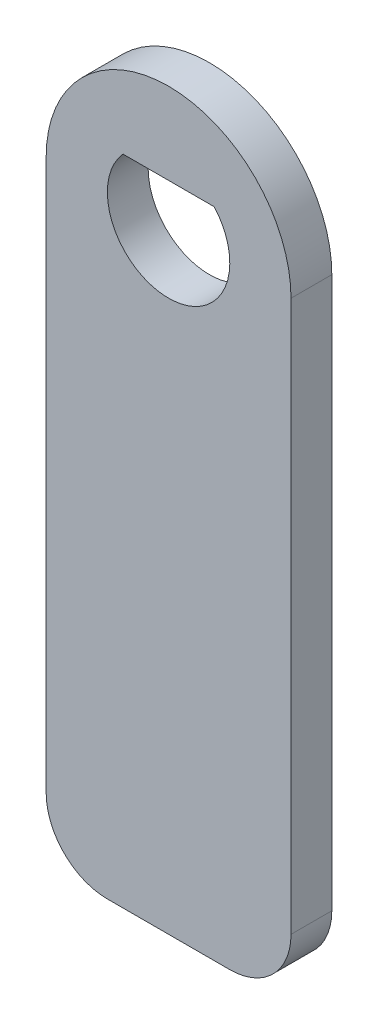
ISO-10303-21;
HEADER;
FILE_DESCRIPTION(('STEP AP214'),'2;1');
FILE_NAME('part.step','',(''),(''),'','','');
FILE_SCHEMA(('AUTOMOTIVE_DESIGN { 1 0 10303 214 1 1 1 1 }'));
ENDSEC;
DATA;
#1=APPLICATION_CONTEXT('core data for automotive mechanical design processes');
#2=APPLICATION_PROTOCOL_DEFINITION('international standard','automotive_design',2000,#1);
#3=PRODUCT_CONTEXT('',#1,'mechanical');
#4=PRODUCT('Part','Part','',(#3));
#5=PRODUCT_RELATED_PRODUCT_CATEGORY('part','',(#4));
#6=PRODUCT_DEFINITION_FORMATION('','',#4);
#7=PRODUCT_DEFINITION_CONTEXT('part definition',#1,'design');
#8=PRODUCT_DEFINITION('design','',#6,#7);
#9=PRODUCT_DEFINITION_SHAPE('','',#8);
#10=(LENGTH_UNIT() NAMED_UNIT(*) SI_UNIT(.MILLI.,.METRE.));
#11=(NAMED_UNIT(*) PLANE_ANGLE_UNIT() SI_UNIT($,.RADIAN.));
#12=(NAMED_UNIT(*) SI_UNIT($,.STERADIAN.) SOLID_ANGLE_UNIT());
#13=UNCERTAINTY_MEASURE_WITH_UNIT(LENGTH_MEASURE(1.E-05),#10,'distance_accuracy_value','');
#14=(GEOMETRIC_REPRESENTATION_CONTEXT(3) GLOBAL_UNCERTAINTY_ASSIGNED_CONTEXT((#13)) GLOBAL_UNIT_ASSIGNED_CONTEXT((#10,
#11,#12)) REPRESENTATION_CONTEXT('',''));
#15=CARTESIAN_POINT('',(0.,0.,0.));
#16=DIRECTION('',(0.,0.,1.));
#17=DIRECTION('',(1.,0.,0.));
#18=AXIS2_PLACEMENT_3D('',#15,#16,#17);
#19=CARTESIAN_POINT('',(3.00000000000001,-27.,2.));
#20=DIRECTION('',(0.,0.,-1.));
#21=DIRECTION('',(-1.,0.,0.));
#22=AXIS2_PLACEMENT_3D('',#19,#20,#21);
#23=PLANE('',#22);
#24=CARTESIAN_POINT('',(3.00000000000001,-27.,2.));
#25=DIRECTION('',(0.,0.,1.));
#26=DIRECTION('',(-1.,0.,0.));
#27=AXIS2_PLACEMENT_3D('',#24,#25,#26);
#28=CIRCLE('',#27,3.);
#29=CARTESIAN_POINT('',(3.00000000000001,-30.,2.));
#30=VERTEX_POINT('',#29);
#31=CARTESIAN_POINT('',(6.00000000000001,-27.,2.));
#32=VERTEX_POINT('',#31);
#33=EDGE_CURVE('E133',#30,#32,#28,.T.);
#34=ORIENTED_EDGE('',*,*,#33,.T.);
#35=DIRECTION('',(0.,1.,0.));
#36=VECTOR('',#35,1.);
#37=CARTESIAN_POINT('',(6.00000000000001,-27.,2.));
#38=LINE('',#37,#36);
#39=CARTESIAN_POINT('',(6.,0.,2.));
#40=VERTEX_POINT('',#39);
#41=EDGE_CURVE('E137',#32,#40,#38,.T.);
#42=ORIENTED_EDGE('',*,*,#41,.T.);
#43=CARTESIAN_POINT('',(0.,0.,2.));
#44=DIRECTION('',(0.,0.,1.));
#45=DIRECTION('',(1.,0.,0.));
#46=AXIS2_PLACEMENT_3D('',#43,#44,#45);
#47=CIRCLE('',#46,6.);
#48=CARTESIAN_POINT('',(-6.,0.,2.));
#49=VERTEX_POINT('',#48);
#50=EDGE_CURVE('E141',#40,#49,#47,.T.);
#51=ORIENTED_EDGE('',*,*,#50,.T.);
#52=DIRECTION('',(0.,-1.,0.));
#53=VECTOR('',#52,1.);
#54=CARTESIAN_POINT('',(-6.,0.,2.));
#55=LINE('',#54,#53);
#56=CARTESIAN_POINT('',(-6.00000000000001,-27.,2.));
#57=VERTEX_POINT('',#56);
#58=EDGE_CURVE('E144',#49,#57,#55,.T.);
#59=ORIENTED_EDGE('',*,*,#58,.T.);
#60=CARTESIAN_POINT('',(-3.00000000000001,-27.,2.));
#61=DIRECTION('',(0.,0.,1.));
#62=DIRECTION('',(-1.,0.,0.));
#63=AXIS2_PLACEMENT_3D('',#60,#61,#62);
#64=CIRCLE('',#63,3.);
#65=CARTESIAN_POINT('',(-3.00000000000001,-30.,2.));
#66=VERTEX_POINT('',#65);
#67=EDGE_CURVE('E147',#57,#66,#64,.T.);
#68=ORIENTED_EDGE('',*,*,#67,.T.);
#69=DIRECTION('',(1.,0.,0.));
#70=VECTOR('',#69,1.);
#71=CARTESIAN_POINT('',(-3.00000000000001,-30.,2.));
#72=LINE('',#71,#70);
#73=EDGE_CURVE('E150',#66,#30,#72,.T.);
#74=ORIENTED_EDGE('',*,*,#73,.T.);
#75=EDGE_LOOP('',(#34,#42,#51,#59,#68,#74));
#76=FACE_BOUND('',#75,.T.);
#77=CARTESIAN_POINT('',(0.,0.,2.));
#78=DIRECTION('',(0.,0.,1.));
#79=DIRECTION('',(1.,0.,0.));
#80=AXIS2_PLACEMENT_3D('',#77,#78,#79);
#81=CIRCLE('',#80,3.);
#82=CARTESIAN_POINT('',(-2.23606797749979,2.,2.));
#83=VERTEX_POINT('',#82);
#84=CARTESIAN_POINT('',(2.23606797749979,2.,2.));
#85=VERTEX_POINT('',#84);
#86=EDGE_CURVE('E117',#83,#85,#81,.T.);
#87=ORIENTED_EDGE('',*,*,#86,.F.);
#88=DIRECTION('',(-1.,0.,0.));
#89=VECTOR('',#88,1.);
#90=CARTESIAN_POINT('',(-2.23606797749979,2.,2.));
#91=LINE('',#90,#89);
#92=EDGE_CURVE('E110',#85,#83,#91,.T.);
#93=ORIENTED_EDGE('',*,*,#92,.F.);
#94=EDGE_LOOP('',(#87,#93));
#95=FACE_BOUND('',#94,.T.);
#96=ADVANCED_FACE('F45',(#76,#95),#23,.F.);
#97=CARTESIAN_POINT('',(3.00000000000001,-27.,0.));
#98=DIRECTION('',(0.,0.,-1.));
#99=DIRECTION('',(-1.,0.,0.));
#100=AXIS2_PLACEMENT_3D('',#97,#98,#99);
#101=PLANE('',#100);
#102=CARTESIAN_POINT('',(3.00000000000001,-27.,0.));
#103=DIRECTION('',(0.,0.,1.));
#104=DIRECTION('',(-1.,0.,0.));
#105=AXIS2_PLACEMENT_3D('',#102,#103,#104);
#106=CIRCLE('',#105,3.);
#107=CARTESIAN_POINT('',(3.00000000000001,-30.,0.));
#108=VERTEX_POINT('',#107);
#109=CARTESIAN_POINT('',(6.00000000000001,-27.,0.));
#110=VERTEX_POINT('',#109);
#111=EDGE_CURVE('E132',#108,#110,#106,.T.);
#112=ORIENTED_EDGE('',*,*,#111,.F.);
#113=DIRECTION('',(1.,0.,0.));
#114=VECTOR('',#113,1.);
#115=CARTESIAN_POINT('',(-3.00000000000001,-30.,0.));
#116=LINE('',#115,#114);
#117=CARTESIAN_POINT('',(-3.00000000000001,-30.,0.));
#118=VERTEX_POINT('',#117);
#119=EDGE_CURVE('E138',#118,#108,#116,.T.);
#120=ORIENTED_EDGE('',*,*,#119,.F.);
#121=CARTESIAN_POINT('',(-3.00000000000001,-27.,0.));
#122=DIRECTION('',(0.,0.,1.));
#123=DIRECTION('',(-1.,0.,0.));
#124=AXIS2_PLACEMENT_3D('',#121,#122,#123);
#125=CIRCLE('',#124,3.);
#126=CARTESIAN_POINT('',(-6.00000000000001,-27.,0.));
#127=VERTEX_POINT('',#126);
#128=EDGE_CURVE('E166',#127,#118,#125,.T.);
#129=ORIENTED_EDGE('',*,*,#128,.F.);
#130=DIRECTION('',(0.,-1.,0.));
#131=VECTOR('',#130,1.);
#132=CARTESIAN_POINT('',(-6.,0.,0.));
#133=LINE('',#132,#131);
#134=CARTESIAN_POINT('',(-6.,0.,0.));
#135=VERTEX_POINT('',#134);
#136=EDGE_CURVE('E163',#135,#127,#133,.T.);
#137=ORIENTED_EDGE('',*,*,#136,.F.);
#138=CARTESIAN_POINT('',(0.,0.,0.));
#139=DIRECTION('',(0.,0.,1.));
#140=DIRECTION('',(1.,0.,0.));
#141=AXIS2_PLACEMENT_3D('',#138,#139,#140);
#142=CIRCLE('',#141,6.);
#143=CARTESIAN_POINT('',(6.,0.,0.));
#144=VERTEX_POINT('',#143);
#145=EDGE_CURVE('E160',#144,#135,#142,.T.);
#146=ORIENTED_EDGE('',*,*,#145,.F.);
#147=DIRECTION('',(0.,1.,0.));
#148=VECTOR('',#147,1.);
#149=CARTESIAN_POINT('',(6.00000000000001,-27.,0.));
#150=LINE('',#149,#148);
#151=EDGE_CURVE('E157',#110,#144,#150,.T.);
#152=ORIENTED_EDGE('',*,*,#151,.F.);
#153=EDGE_LOOP('',(#112,#120,#129,#137,#146,#152));
#154=FACE_BOUND('',#153,.T.);
#155=DIRECTION('',(-1.,0.,0.));
#156=VECTOR('',#155,1.);
#157=CARTESIAN_POINT('',(-2.23606797749979,2.,0.));
#158=LINE('',#157,#156);
#159=CARTESIAN_POINT('',(2.23606797749979,2.,0.));
#160=VERTEX_POINT('',#159);
#161=CARTESIAN_POINT('',(-2.23606797749979,2.,0.));
#162=VERTEX_POINT('',#161);
#163=EDGE_CURVE('E123',#160,#162,#158,.T.);
#164=ORIENTED_EDGE('',*,*,#163,.T.);
#165=CARTESIAN_POINT('',(0.,0.,0.));
#166=DIRECTION('',(0.,0.,1.));
#167=DIRECTION('',(1.,0.,0.));
#168=AXIS2_PLACEMENT_3D('',#165,#166,#167);
#169=CIRCLE('',#168,3.);
#170=EDGE_CURVE('E68',#162,#160,#169,.T.);
#171=ORIENTED_EDGE('',*,*,#170,.T.);
#172=EDGE_LOOP('',(#164,#171));
#173=FACE_BOUND('',#172,.T.);
#174=ADVANCED_FACE('F197',(#154,#173),#101,.T.);
#175=CARTESIAN_POINT('',(3.00000000000001,-27.,2.));
#176=DIRECTION('',(0.,0.,-1.));
#177=DIRECTION('',(-1.,0.,0.));
#178=AXIS2_PLACEMENT_3D('',#175,#176,#177);
#179=CYLINDRICAL_SURFACE('',#178,3.);
#180=ORIENTED_EDGE('',*,*,#111,.T.);
#181=DIRECTION('',(0.,0.,-1.));
#182=VECTOR('',#181,1.);
#183=CARTESIAN_POINT('',(6.00000000000001,-27.,2.));
#184=LINE('',#183,#182);
#185=EDGE_CURVE('E11',#32,#110,#184,.T.);
#186=ORIENTED_EDGE('',*,*,#185,.F.);
#187=ORIENTED_EDGE('',*,*,#33,.F.);
#188=DIRECTION('',(0.,0.,-1.));
#189=VECTOR('',#188,1.);
#190=CARTESIAN_POINT('',(3.00000000000001,-30.,2.));
#191=LINE('',#190,#189);
#192=EDGE_CURVE('E153',#30,#108,#191,.T.);
#193=ORIENTED_EDGE('',*,*,#192,.T.);
#194=EDGE_LOOP('',(#180,#186,#187,#193));
#195=FACE_BOUND('',#194,.T.);
#196=ADVANCED_FACE('F47',(#195),#179,.T.);
#197=CARTESIAN_POINT('',(6.00000000000001,-27.,2.));
#198=DIRECTION('',(-1.,0.,0.));
#199=DIRECTION('',(0.,-1.,0.));
#200=AXIS2_PLACEMENT_3D('',#197,#198,#199);
#201=PLANE('',#200);
#202=ORIENTED_EDGE('',*,*,#151,.T.);
#203=DIRECTION('',(0.,0.,-1.));
#204=VECTOR('',#203,1.);
#205=CARTESIAN_POINT('',(6.,0.,2.));
#206=LINE('',#205,#204);
#207=EDGE_CURVE('E54',#40,#144,#206,.T.);
#208=ORIENTED_EDGE('',*,*,#207,.F.);
#209=ORIENTED_EDGE('',*,*,#41,.F.);
#210=ORIENTED_EDGE('',*,*,#185,.T.);
#211=EDGE_LOOP('',(#202,#208,#209,#210));
#212=FACE_BOUND('',#211,.T.);
#213=ADVANCED_FACE('F214',(#212),#201,.F.);
#214=CARTESIAN_POINT('',(0.,0.,2.));
#215=DIRECTION('',(0.,0.,-1.));
#216=DIRECTION('',(-1.,0.,0.));
#217=AXIS2_PLACEMENT_3D('',#214,#215,#216);
#218=CYLINDRICAL_SURFACE('',#217,6.);
#219=ORIENTED_EDGE('',*,*,#145,.T.);
#220=DIRECTION('',(0.,0.,-1.));
#221=VECTOR('',#220,1.);
#222=CARTESIAN_POINT('',(-6.,0.,2.));
#223=LINE('',#222,#221);
#224=EDGE_CURVE('E182',#49,#135,#223,.T.);
#225=ORIENTED_EDGE('',*,*,#224,.F.);
#226=ORIENTED_EDGE('',*,*,#50,.F.);
#227=ORIENTED_EDGE('',*,*,#207,.T.);
#228=EDGE_LOOP('',(#219,#225,#226,#227));
#229=FACE_BOUND('',#228,.T.);
#230=ADVANCED_FACE('F191',(#229),#218,.T.);
#231=CARTESIAN_POINT('',(-6.,0.,2.));
#232=DIRECTION('',(1.,0.,0.));
#233=DIRECTION('',(0.,1.,0.));
#234=AXIS2_PLACEMENT_3D('',#231,#232,#233);
#235=PLANE('',#234);
#236=ORIENTED_EDGE('',*,*,#136,.T.);
#237=DIRECTION('',(0.,0.,-1.));
#238=VECTOR('',#237,1.);
#239=CARTESIAN_POINT('',(-6.00000000000001,-27.,2.));
#240=LINE('',#239,#238);
#241=EDGE_CURVE('E178',#57,#127,#240,.T.);
#242=ORIENTED_EDGE('',*,*,#241,.F.);
#243=ORIENTED_EDGE('',*,*,#58,.F.);
#244=ORIENTED_EDGE('',*,*,#224,.T.);
#245=EDGE_LOOP('',(#236,#242,#243,#244));
#246=FACE_BOUND('',#245,.T.);
#247=ADVANCED_FACE('F203',(#246),#235,.F.);
#248=CARTESIAN_POINT('',(-3.00000000000001,-27.,2.));
#249=DIRECTION('',(0.,0.,-1.));
#250=DIRECTION('',(-1.,0.,0.));
#251=AXIS2_PLACEMENT_3D('',#248,#249,#250);
#252=CYLINDRICAL_SURFACE('',#251,3.);
#253=ORIENTED_EDGE('',*,*,#128,.T.);
#254=DIRECTION('',(0.,0.,-1.));
#255=VECTOR('',#254,1.);
#256=CARTESIAN_POINT('',(-3.00000000000001,-30.,2.));
#257=LINE('',#256,#255);
#258=EDGE_CURVE('E174',#66,#118,#257,.T.);
#259=ORIENTED_EDGE('',*,*,#258,.F.);
#260=ORIENTED_EDGE('',*,*,#67,.F.);
#261=ORIENTED_EDGE('',*,*,#241,.T.);
#262=EDGE_LOOP('',(#253,#259,#260,#261));
#263=FACE_BOUND('',#262,.T.);
#264=ADVANCED_FACE('F207',(#263),#252,.T.);
#265=CARTESIAN_POINT('',(-3.00000000000001,-30.,2.));
#266=DIRECTION('',(0.,1.,0.));
#267=DIRECTION('',(0.,0.,1.));
#268=AXIS2_PLACEMENT_3D('',#265,#266,#267);
#269=PLANE('',#268);
#270=ORIENTED_EDGE('',*,*,#119,.T.);
#271=ORIENTED_EDGE('',*,*,#192,.F.);
#272=ORIENTED_EDGE('',*,*,#73,.F.);
#273=ORIENTED_EDGE('',*,*,#258,.T.);
#274=EDGE_LOOP('',(#270,#271,#272,#273));
#275=FACE_BOUND('',#274,.T.);
#276=ADVANCED_FACE('F217',(#275),#269,.F.);
#277=CARTESIAN_POINT('',(0.,0.,2.));
#278=DIRECTION('',(0.,0.,-1.));
#279=DIRECTION('',(-1.,0.,0.));
#280=AXIS2_PLACEMENT_3D('',#277,#278,#279);
#281=CYLINDRICAL_SURFACE('',#280,3.);
#282=ORIENTED_EDGE('',*,*,#170,.F.);
#283=DIRECTION('',(0.,0.,-1.));
#284=VECTOR('',#283,1.);
#285=CARTESIAN_POINT('',(-2.23606797749979,2.,2.));
#286=LINE('',#285,#284);
#287=EDGE_CURVE('E112',#83,#162,#286,.T.);
#288=ORIENTED_EDGE('',*,*,#287,.F.);
#289=ORIENTED_EDGE('',*,*,#86,.T.);
#290=DIRECTION('',(0.,0.,-1.));
#291=VECTOR('',#290,1.);
#292=CARTESIAN_POINT('',(2.23606797749979,2.,2.));
#293=LINE('',#292,#291);
#294=EDGE_CURVE('E61',#85,#160,#293,.T.);
#295=ORIENTED_EDGE('',*,*,#294,.T.);
#296=EDGE_LOOP('',(#282,#288,#289,#295));
#297=FACE_BOUND('',#296,.T.);
#298=ADVANCED_FACE('F119',(#297),#281,.F.);
#299=CARTESIAN_POINT('',(-2.23606797749979,2.,2.));
#300=DIRECTION('',(0.,-1.,0.));
#301=DIRECTION('',(0.,0.,-1.));
#302=AXIS2_PLACEMENT_3D('',#299,#300,#301);
#303=PLANE('',#302);
#304=ORIENTED_EDGE('',*,*,#163,.F.);
#305=ORIENTED_EDGE('',*,*,#294,.F.);
#306=ORIENTED_EDGE('',*,*,#92,.T.);
#307=ORIENTED_EDGE('',*,*,#287,.T.);
#308=EDGE_LOOP('',(#304,#305,#306,#307));
#309=FACE_BOUND('',#308,.T.);
#310=ADVANCED_FACE('F111',(#309),#303,.T.);
#311=CLOSED_SHELL('',(#96,#174,#196,#213,#230,#247,#264,#276,#298,#310));
#312=MANIFOLD_SOLID_BREP('B2',#311);
#313=ADVANCED_BREP_SHAPE_REPRESENTATION('',(#18,#312),#14);
#314=SHAPE_DEFINITION_REPRESENTATION(#9,#313);
ENDSEC;
END-ISO-10303-21;
